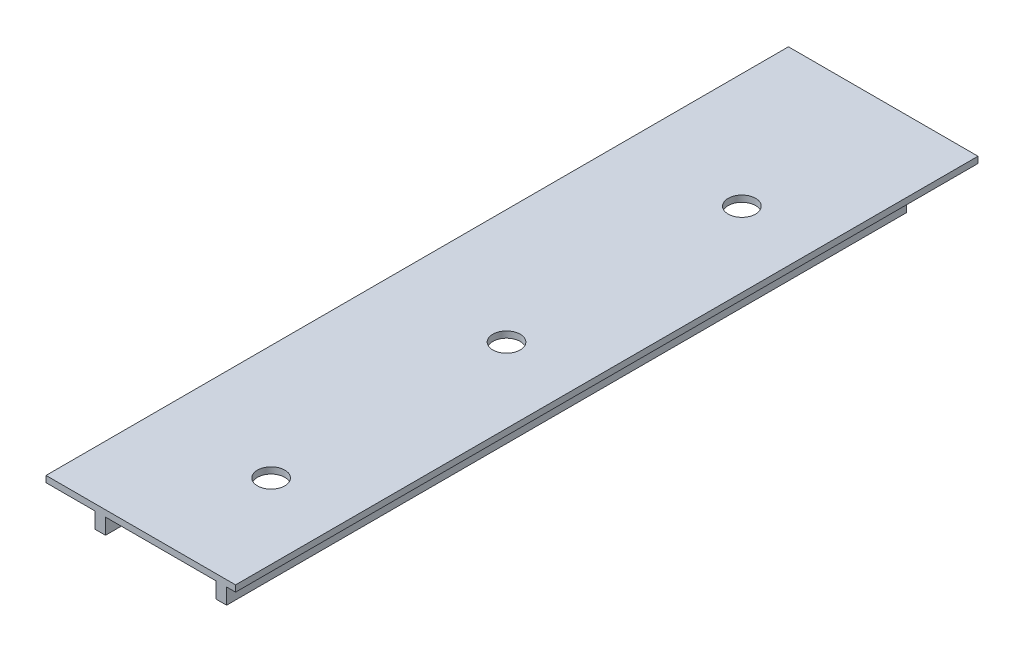
ISO-10303-21;
HEADER;
FILE_DESCRIPTION(('STEP AP214'),'2;1');
FILE_NAME('part.step','',(''),(''),'','','');
FILE_SCHEMA(('AUTOMOTIVE_DESIGN { 1 0 10303 214 1 1 1 1 }'));
ENDSEC;
DATA;
#1=APPLICATION_CONTEXT('core data for automotive mechanical design processes');
#2=APPLICATION_PROTOCOL_DEFINITION('international standard','automotive_design',2000,#1);
#3=PRODUCT_CONTEXT('',#1,'mechanical');
#4=PRODUCT('Part','Part','',(#3));
#5=PRODUCT_RELATED_PRODUCT_CATEGORY('part','',(#4));
#6=PRODUCT_DEFINITION_FORMATION('','',#4);
#7=PRODUCT_DEFINITION_CONTEXT('part definition',#1,'design');
#8=PRODUCT_DEFINITION('design','',#6,#7);
#9=PRODUCT_DEFINITION_SHAPE('','',#8);
#10=(LENGTH_UNIT() NAMED_UNIT(*) SI_UNIT(.MILLI.,.METRE.));
#11=(NAMED_UNIT(*) PLANE_ANGLE_UNIT() SI_UNIT($,.RADIAN.));
#12=(NAMED_UNIT(*) SI_UNIT($,.STERADIAN.) SOLID_ANGLE_UNIT());
#13=UNCERTAINTY_MEASURE_WITH_UNIT(LENGTH_MEASURE(1.E-05),#10,'distance_accuracy_value','');
#14=(GEOMETRIC_REPRESENTATION_CONTEXT(3) GLOBAL_UNCERTAINTY_ASSIGNED_CONTEXT((#13)) GLOBAL_UNIT_ASSIGNED_CONTEXT((#10,
#11,#12)) REPRESENTATION_CONTEXT('',''));
#15=CARTESIAN_POINT('',(0.,0.,0.));
#16=DIRECTION('',(0.,0.,1.));
#17=DIRECTION('',(1.,0.,0.));
#18=AXIS2_PLACEMENT_3D('',#15,#16,#17);
#19=CARTESIAN_POINT('',(0.,0.6,0.));
#20=DIRECTION('',(1.,0.,0.));
#21=DIRECTION('',(0.,0.,-1.));
#22=AXIS2_PLACEMENT_3D('',#19,#20,#21);
#23=PLANE('',#22);
#24=DIRECTION('',(0.,0.,1.));
#25=VECTOR('',#24,1.);
#26=CARTESIAN_POINT('',(0.,0.,0.));
#27=LINE('',#26,#25);
#28=CARTESIAN_POINT('',(0.,0.,-70.5));
#29=VERTEX_POINT('',#28);
#30=CARTESIAN_POINT('',(0.,0.,0.));
#31=VERTEX_POINT('',#30);
#32=EDGE_CURVE('E212',#29,#31,#27,.T.);
#33=ORIENTED_EDGE('',*,*,#32,.T.);
#34=DIRECTION('',(0.,-1.,0.));
#35=VECTOR('',#34,1.);
#36=CARTESIAN_POINT('',(0.,0.6,0.));
#37=LINE('',#36,#35);
#38=CARTESIAN_POINT('',(0.,0.6,0.));
#39=VERTEX_POINT('',#38);
#40=EDGE_CURVE('E11',#39,#31,#37,.T.);
#41=ORIENTED_EDGE('',*,*,#40,.F.);
#42=DIRECTION('',(0.,0.,1.));
#43=VECTOR('',#42,1.);
#44=CARTESIAN_POINT('',(0.,0.6,0.));
#45=LINE('',#44,#43);
#46=CARTESIAN_POINT('',(0.,0.6,-70.5));
#47=VERTEX_POINT('',#46);
#48=EDGE_CURVE('E201',#47,#39,#45,.T.);
#49=ORIENTED_EDGE('',*,*,#48,.F.);
#50=DIRECTION('',(0.,-1.,0.));
#51=VECTOR('',#50,1.);
#52=CARTESIAN_POINT('',(0.,0.6,-70.5));
#53=LINE('',#52,#51);
#54=EDGE_CURVE('E211',#47,#29,#53,.T.);
#55=ORIENTED_EDGE('',*,*,#54,.T.);
#56=EDGE_LOOP('',(#33,#41,#49,#55));
#57=FACE_BOUND('',#56,.T.);
#58=ADVANCED_FACE('F35',(#57),#23,.F.);
#59=CARTESIAN_POINT('',(0.,0.6,0.));
#60=DIRECTION('',(0.,0.,-1.));
#61=DIRECTION('',(-1.,0.,0.));
#62=AXIS2_PLACEMENT_3D('',#59,#60,#61);
#63=PLANE('',#62);
#64=DIRECTION('',(1.,0.,0.));
#65=VECTOR('',#64,1.);
#66=CARTESIAN_POINT('',(0.,0.,0.));
#67=LINE('',#66,#65);
#68=CARTESIAN_POINT('',(4.65,0.,0.));
#69=VERTEX_POINT('',#68);
#70=EDGE_CURVE('E216',#31,#69,#67,.T.);
#71=ORIENTED_EDGE('',*,*,#70,.T.);
#72=DIRECTION('',(0.,1.,0.));
#73=VECTOR('',#72,1.);
#74=CARTESIAN_POINT('',(4.65,-1.5,0.));
#75=LINE('',#74,#73);
#76=CARTESIAN_POINT('',(4.65,-1.5,0.));
#77=VERTEX_POINT('',#76);
#78=EDGE_CURVE('E135',#77,#69,#75,.T.);
#79=ORIENTED_EDGE('',*,*,#78,.F.);
#80=DIRECTION('',(-1.,0.,0.));
#81=VECTOR('',#80,1.);
#82=CARTESIAN_POINT('',(0.,-1.5,0.));
#83=LINE('',#82,#81);
#84=CARTESIAN_POINT('',(5.65,-1.5,0.));
#85=VERTEX_POINT('',#84);
#86=EDGE_CURVE('E138',#85,#77,#83,.T.);
#87=ORIENTED_EDGE('',*,*,#86,.F.);
#88=DIRECTION('',(0.,1.,0.));
#89=VECTOR('',#88,1.);
#90=CARTESIAN_POINT('',(5.65,-1.5,0.));
#91=LINE('',#90,#89);
#92=CARTESIAN_POINT('',(5.65,0.,0.));
#93=VERTEX_POINT('',#92);
#94=EDGE_CURVE('E126',#85,#93,#91,.T.);
#95=ORIENTED_EDGE('',*,*,#94,.T.);
#96=CARTESIAN_POINT('',(16.15,0.,0.));
#97=VERTEX_POINT('',#96);
#98=EDGE_CURVE('E219',#93,#97,#67,.T.);
#99=ORIENTED_EDGE('',*,*,#98,.T.);
#100=DIRECTION('',(0.,1.,0.));
#101=VECTOR('',#100,1.);
#102=CARTESIAN_POINT('',(16.15,-1.5,0.));
#103=LINE('',#102,#101);
#104=CARTESIAN_POINT('',(16.15,-1.5,0.));
#105=VERTEX_POINT('',#104);
#106=EDGE_CURVE('E182',#105,#97,#103,.T.);
#107=ORIENTED_EDGE('',*,*,#106,.F.);
#108=DIRECTION('',(-1.,0.,0.));
#109=VECTOR('',#108,1.);
#110=CARTESIAN_POINT('',(0.,-1.5,0.));
#111=LINE('',#110,#109);
#112=CARTESIAN_POINT('',(17.15,-1.5,0.));
#113=VERTEX_POINT('',#112);
#114=EDGE_CURVE('E170',#113,#105,#111,.T.);
#115=ORIENTED_EDGE('',*,*,#114,.F.);
#116=DIRECTION('',(0.,1.,0.));
#117=VECTOR('',#116,1.);
#118=CARTESIAN_POINT('',(17.15,-1.5,0.));
#119=LINE('',#118,#117);
#120=CARTESIAN_POINT('',(17.15,0.,0.));
#121=VERTEX_POINT('',#120);
#122=EDGE_CURVE('E185',#113,#121,#119,.T.);
#123=ORIENTED_EDGE('',*,*,#122,.T.);
#124=CARTESIAN_POINT('',(18.,0.,0.));
#125=VERTEX_POINT('',#124);
#126=EDGE_CURVE('E215',#121,#125,#67,.T.);
#127=ORIENTED_EDGE('',*,*,#126,.T.);
#128=DIRECTION('',(0.,-1.,0.));
#129=VECTOR('',#128,1.);
#130=CARTESIAN_POINT('',(18.,0.6,0.));
#131=LINE('',#130,#129);
#132=CARTESIAN_POINT('',(18.,0.6,0.));
#133=VERTEX_POINT('',#132);
#134=EDGE_CURVE('E43',#133,#125,#131,.T.);
#135=ORIENTED_EDGE('',*,*,#134,.F.);
#136=DIRECTION('',(1.,0.,0.));
#137=VECTOR('',#136,1.);
#138=CARTESIAN_POINT('',(0.,0.6,0.));
#139=LINE('',#138,#137);
#140=EDGE_CURVE('E204',#39,#133,#139,.T.);
#141=ORIENTED_EDGE('',*,*,#140,.F.);
#142=ORIENTED_EDGE('',*,*,#40,.T.);
#143=EDGE_LOOP('',(#71,#79,#87,#95,#99,#107,#115,#123,#127,#135,#141,#142));
#144=FACE_BOUND('',#143,.T.);
#145=ADVANCED_FACE('F140',(#144),#63,.F.);
#146=CARTESIAN_POINT('',(18.,0.6,0.));
#147=DIRECTION('',(-1.,0.,0.));
#148=DIRECTION('',(0.,0.,1.));
#149=AXIS2_PLACEMENT_3D('',#146,#147,#148);
#150=PLANE('',#149);
#151=DIRECTION('',(0.,0.,-1.));
#152=VECTOR('',#151,1.);
#153=CARTESIAN_POINT('',(18.,0.,0.));
#154=LINE('',#153,#152);
#155=CARTESIAN_POINT('',(18.,0.,-70.5));
#156=VERTEX_POINT('',#155);
#157=EDGE_CURVE('E218',#125,#156,#154,.T.);
#158=ORIENTED_EDGE('',*,*,#157,.T.);
#159=DIRECTION('',(0.,-1.,0.));
#160=VECTOR('',#159,1.);
#161=CARTESIAN_POINT('',(18.,0.6,-70.5));
#162=LINE('',#161,#160);
#163=CARTESIAN_POINT('',(18.,0.6,-70.5));
#164=VERTEX_POINT('',#163);
#165=EDGE_CURVE('E224',#164,#156,#162,.T.);
#166=ORIENTED_EDGE('',*,*,#165,.F.);
#167=DIRECTION('',(0.,0.,-1.));
#168=VECTOR('',#167,1.);
#169=CARTESIAN_POINT('',(18.,0.6,0.));
#170=LINE('',#169,#168);
#171=EDGE_CURVE('E207',#133,#164,#170,.T.);
#172=ORIENTED_EDGE('',*,*,#171,.F.);
#173=ORIENTED_EDGE('',*,*,#134,.T.);
#174=EDGE_LOOP('',(#158,#166,#172,#173));
#175=FACE_BOUND('',#174,.T.);
#176=ADVANCED_FACE('F271',(#175),#150,.F.);
#177=CARTESIAN_POINT('',(0.,0.6,-70.5));
#178=DIRECTION('',(0.,0.,1.));
#179=DIRECTION('',(1.,0.,0.));
#180=AXIS2_PLACEMENT_3D('',#177,#178,#179);
#181=PLANE('',#180);
#182=DIRECTION('',(-1.,0.,0.));
#183=VECTOR('',#182,1.);
#184=CARTESIAN_POINT('',(0.,0.,-70.5));
#185=LINE('',#184,#183);
#186=EDGE_CURVE('E205',#156,#29,#185,.T.);
#187=ORIENTED_EDGE('',*,*,#186,.T.);
#188=ORIENTED_EDGE('',*,*,#54,.F.);
#189=DIRECTION('',(-1.,0.,0.));
#190=VECTOR('',#189,1.);
#191=CARTESIAN_POINT('',(0.,0.6,-70.5));
#192=LINE('',#191,#190);
#193=EDGE_CURVE('E209',#164,#47,#192,.T.);
#194=ORIENTED_EDGE('',*,*,#193,.F.);
#195=ORIENTED_EDGE('',*,*,#165,.T.);
#196=EDGE_LOOP('',(#187,#188,#194,#195));
#197=FACE_BOUND('',#196,.T.);
#198=ADVANCED_FACE('F257',(#197),#181,.F.);
#199=CARTESIAN_POINT('',(0.,0.6,0.));
#200=DIRECTION('',(0.,-1.,0.));
#201=DIRECTION('',(0.,0.,-1.));
#202=AXIS2_PLACEMENT_3D('',#199,#200,#201);
#203=PLANE('',#202);
#204=CARTESIAN_POINT('',(10.9,0.6,-10.48));
#205=DIRECTION('',(0.,1.,0.));
#206=DIRECTION('',(0.,0.,1.));
#207=AXIS2_PLACEMENT_3D('',#204,#205,#206);
#208=CIRCLE('',#207,1.3);
#209=CARTESIAN_POINT('',(10.9,0.6,-9.18));
#210=VERTEX_POINT('',#209);
#211=EDGE_CURVE('E192',#210,#210,#208,.T.);
#212=ORIENTED_EDGE('',*,*,#211,.F.);
#213=EDGE_LOOP('',(#212));
#214=FACE_BOUND('',#213,.T.);
#215=CARTESIAN_POINT('',(10.9,0.6,-32.83));
#216=DIRECTION('',(0.,1.,0.));
#217=DIRECTION('',(0.,0.,1.));
#218=AXIS2_PLACEMENT_3D('',#215,#216,#217);
#219=CIRCLE('',#218,1.3);
#220=CARTESIAN_POINT('',(10.9,0.6,-31.53));
#221=VERTEX_POINT('',#220);
#222=EDGE_CURVE('E196',#221,#221,#219,.T.);
#223=ORIENTED_EDGE('',*,*,#222,.F.);
#224=EDGE_LOOP('',(#223));
#225=FACE_BOUND('',#224,.T.);
#226=CARTESIAN_POINT('',(10.9,0.6,-55.18));
#227=DIRECTION('',(0.,1.,0.));
#228=DIRECTION('',(0.,0.,1.));
#229=AXIS2_PLACEMENT_3D('',#226,#227,#228);
#230=CIRCLE('',#229,1.3);
#231=CARTESIAN_POINT('',(10.9,0.6,-53.88));
#232=VERTEX_POINT('',#231);
#233=EDGE_CURVE('E191',#232,#232,#230,.T.);
#234=ORIENTED_EDGE('',*,*,#233,.F.);
#235=EDGE_LOOP('',(#234));
#236=FACE_BOUND('',#235,.T.);
#237=ORIENTED_EDGE('',*,*,#48,.T.);
#238=ORIENTED_EDGE('',*,*,#140,.T.);
#239=ORIENTED_EDGE('',*,*,#171,.T.);
#240=ORIENTED_EDGE('',*,*,#193,.T.);
#241=EDGE_LOOP('',(#237,#238,#239,#240));
#242=FACE_BOUND('',#241,.T.);
#243=ADVANCED_FACE('F244',(#214,#225,#236,#242),#203,.F.);
#244=CARTESIAN_POINT('',(0.,0.,0.));
#245=DIRECTION('',(0.,-1.,0.));
#246=DIRECTION('',(0.,0.,-1.));
#247=AXIS2_PLACEMENT_3D('',#244,#245,#246);
#248=PLANE('',#247);
#249=DIRECTION('',(0.,0.,-1.));
#250=VECTOR('',#249,1.);
#251=CARTESIAN_POINT('',(5.65,0.,0.));
#252=LINE('',#251,#250);
#253=CARTESIAN_POINT('',(5.65,0.,-64.56));
#254=VERTEX_POINT('',#253);
#255=EDGE_CURVE('E132',#93,#254,#252,.T.);
#256=ORIENTED_EDGE('',*,*,#255,.T.);
#257=DIRECTION('',(1.,0.,0.));
#258=VECTOR('',#257,1.);
#259=CARTESIAN_POINT('',(0.,0.,-64.56));
#260=LINE('',#259,#258);
#261=CARTESIAN_POINT('',(4.65,0.,-64.56));
#262=VERTEX_POINT('',#261);
#263=EDGE_CURVE('E150',#262,#254,#260,.T.);
#264=ORIENTED_EDGE('',*,*,#263,.F.);
#265=DIRECTION('',(0.,0.,1.));
#266=VECTOR('',#265,1.);
#267=CARTESIAN_POINT('',(4.65,0.,0.));
#268=LINE('',#267,#266);
#269=EDGE_CURVE('E51',#262,#69,#268,.T.);
#270=ORIENTED_EDGE('',*,*,#269,.T.);
#271=ORIENTED_EDGE('',*,*,#70,.F.);
#272=ORIENTED_EDGE('',*,*,#32,.F.);
#273=ORIENTED_EDGE('',*,*,#186,.F.);
#274=ORIENTED_EDGE('',*,*,#157,.F.);
#275=ORIENTED_EDGE('',*,*,#126,.F.);
#276=DIRECTION('',(0.,0.,1.));
#277=VECTOR('',#276,1.);
#278=CARTESIAN_POINT('',(17.15,0.,0.));
#279=LINE('',#278,#277);
#280=CARTESIAN_POINT('',(17.15,0.,-64.56));
#281=VERTEX_POINT('',#280);
#282=EDGE_CURVE('E176',#281,#121,#279,.T.);
#283=ORIENTED_EDGE('',*,*,#282,.F.);
#284=DIRECTION('',(1.,0.,0.));
#285=VECTOR('',#284,1.);
#286=CARTESIAN_POINT('',(0.,0.,-64.56));
#287=LINE('',#286,#285);
#288=CARTESIAN_POINT('',(16.15,0.,-64.56));
#289=VERTEX_POINT('',#288);
#290=EDGE_CURVE('E59',#289,#281,#287,.T.);
#291=ORIENTED_EDGE('',*,*,#290,.F.);
#292=DIRECTION('',(0.,0.,-1.));
#293=VECTOR('',#292,1.);
#294=CARTESIAN_POINT('',(16.15,0.,0.));
#295=LINE('',#294,#293);
#296=EDGE_CURVE('E168',#97,#289,#295,.T.);
#297=ORIENTED_EDGE('',*,*,#296,.F.);
#298=ORIENTED_EDGE('',*,*,#98,.F.);
#299=EDGE_LOOP('',(#256,#264,#270,#271,#272,#273,#274,#275,#283,#291,#297,#298));
#300=FACE_BOUND('',#299,.T.);
#301=CARTESIAN_POINT('',(10.9,0.,-10.48));
#302=DIRECTION('',(0.,-1.,0.));
#303=DIRECTION('',(0.,0.,-1.));
#304=AXIS2_PLACEMENT_3D('',#301,#302,#303);
#305=CIRCLE('',#304,1.3);
#306=CARTESIAN_POINT('',(10.9,0.,-11.78));
#307=VERTEX_POINT('',#306);
#308=EDGE_CURVE('E38',#307,#307,#305,.T.);
#309=ORIENTED_EDGE('',*,*,#308,.F.);
#310=EDGE_LOOP('',(#309));
#311=FACE_BOUND('',#310,.T.);
#312=CARTESIAN_POINT('',(10.9,0.,-32.83));
#313=DIRECTION('',(0.,-1.,0.));
#314=DIRECTION('',(0.,0.,-1.));
#315=AXIS2_PLACEMENT_3D('',#312,#313,#314);
#316=CIRCLE('',#315,1.3);
#317=CARTESIAN_POINT('',(10.9,0.,-34.13));
#318=VERTEX_POINT('',#317);
#319=EDGE_CURVE('E230',#318,#318,#316,.T.);
#320=ORIENTED_EDGE('',*,*,#319,.F.);
#321=EDGE_LOOP('',(#320));
#322=FACE_BOUND('',#321,.T.);
#323=CARTESIAN_POINT('',(10.9,0.,-55.18));
#324=DIRECTION('',(0.,-1.,0.));
#325=DIRECTION('',(0.,0.,-1.));
#326=AXIS2_PLACEMENT_3D('',#323,#324,#325);
#327=CIRCLE('',#326,1.3);
#328=CARTESIAN_POINT('',(10.9,0.,-56.48));
#329=VERTEX_POINT('',#328);
#330=EDGE_CURVE('E195',#329,#329,#327,.T.);
#331=ORIENTED_EDGE('',*,*,#330,.F.);
#332=EDGE_LOOP('',(#331));
#333=FACE_BOUND('',#332,.T.);
#334=ADVANCED_FACE('F240',(#300,#311,#322,#333),#248,.T.);
#335=CARTESIAN_POINT('',(10.9,-9.4,-55.18));
#336=DIRECTION('',(0.,1.,0.));
#337=DIRECTION('',(0.,0.,1.));
#338=AXIS2_PLACEMENT_3D('',#335,#336,#337);
#339=CYLINDRICAL_SURFACE('',#338,1.3);
#340=ORIENTED_EDGE('',*,*,#330,.T.);
#341=EDGE_LOOP('',(#340));
#342=FACE_BOUND('',#341,.T.);
#343=ORIENTED_EDGE('',*,*,#233,.T.);
#344=EDGE_LOOP('',(#343));
#345=FACE_BOUND('',#344,.T.);
#346=ADVANCED_FACE('F243',(#342,#345),#339,.F.);
#347=CARTESIAN_POINT('',(10.9,-9.4,-32.83));
#348=DIRECTION('',(0.,1.,0.));
#349=DIRECTION('',(0.,0.,1.));
#350=AXIS2_PLACEMENT_3D('',#347,#348,#349);
#351=CYLINDRICAL_SURFACE('',#350,1.3);
#352=ORIENTED_EDGE('',*,*,#319,.T.);
#353=EDGE_LOOP('',(#352));
#354=FACE_BOUND('',#353,.T.);
#355=ORIENTED_EDGE('',*,*,#222,.T.);
#356=EDGE_LOOP('',(#355));
#357=FACE_BOUND('',#356,.T.);
#358=ADVANCED_FACE('F251',(#354,#357),#351,.F.);
#359=CARTESIAN_POINT('',(10.9,-9.4,-10.48));
#360=DIRECTION('',(0.,1.,0.));
#361=DIRECTION('',(0.,0.,1.));
#362=AXIS2_PLACEMENT_3D('',#359,#360,#361);
#363=CYLINDRICAL_SURFACE('',#362,1.3);
#364=ORIENTED_EDGE('',*,*,#308,.T.);
#365=EDGE_LOOP('',(#364));
#366=FACE_BOUND('',#365,.T.);
#367=ORIENTED_EDGE('',*,*,#211,.T.);
#368=EDGE_LOOP('',(#367));
#369=FACE_BOUND('',#368,.T.);
#370=ADVANCED_FACE('F237',(#366,#369),#363,.F.);
#371=CARTESIAN_POINT('',(0.,-1.5,-64.56));
#372=DIRECTION('',(0.,0.,1.));
#373=DIRECTION('',(1.,0.,0.));
#374=AXIS2_PLACEMENT_3D('',#371,#372,#373);
#375=PLANE('',#374);
#376=ORIENTED_EDGE('',*,*,#290,.T.);
#377=DIRECTION('',(0.,1.,0.));
#378=VECTOR('',#377,1.);
#379=CARTESIAN_POINT('',(17.15,-1.5,-64.56));
#380=LINE('',#379,#378);
#381=CARTESIAN_POINT('',(17.15,-1.5,-64.56));
#382=VERTEX_POINT('',#381);
#383=EDGE_CURVE('E188',#382,#281,#380,.T.);
#384=ORIENTED_EDGE('',*,*,#383,.F.);
#385=DIRECTION('',(1.,0.,0.));
#386=VECTOR('',#385,1.);
#387=CARTESIAN_POINT('',(0.,-1.5,-64.56));
#388=LINE('',#387,#386);
#389=CARTESIAN_POINT('',(16.15,-1.5,-64.56));
#390=VERTEX_POINT('',#389);
#391=EDGE_CURVE('E164',#390,#382,#388,.T.);
#392=ORIENTED_EDGE('',*,*,#391,.F.);
#393=DIRECTION('',(0.,1.,0.));
#394=VECTOR('',#393,1.);
#395=CARTESIAN_POINT('',(16.15,-1.5,-64.56));
#396=LINE('',#395,#394);
#397=EDGE_CURVE('E174',#390,#289,#396,.T.);
#398=ORIENTED_EDGE('',*,*,#397,.T.);
#399=EDGE_LOOP('',(#376,#384,#392,#398));
#400=FACE_BOUND('',#399,.T.);
#401=ADVANCED_FACE('F302',(#400),#375,.F.);
#402=CARTESIAN_POINT('',(17.15,-1.5,0.));
#403=DIRECTION('',(-1.,0.,0.));
#404=DIRECTION('',(0.,0.,1.));
#405=AXIS2_PLACEMENT_3D('',#402,#403,#404);
#406=PLANE('',#405);
#407=ORIENTED_EDGE('',*,*,#282,.T.);
#408=ORIENTED_EDGE('',*,*,#122,.F.);
#409=DIRECTION('',(0.,0.,1.));
#410=VECTOR('',#409,1.);
#411=CARTESIAN_POINT('',(17.15,-1.5,0.));
#412=LINE('',#411,#410);
#413=EDGE_CURVE('E167',#382,#113,#412,.T.);
#414=ORIENTED_EDGE('',*,*,#413,.F.);
#415=ORIENTED_EDGE('',*,*,#383,.T.);
#416=EDGE_LOOP('',(#407,#408,#414,#415));
#417=FACE_BOUND('',#416,.T.);
#418=ADVANCED_FACE('F305',(#417),#406,.F.);
#419=CARTESIAN_POINT('',(16.15,-1.5,0.));
#420=DIRECTION('',(1.,0.,0.));
#421=DIRECTION('',(0.,0.,-1.));
#422=AXIS2_PLACEMENT_3D('',#419,#420,#421);
#423=PLANE('',#422);
#424=ORIENTED_EDGE('',*,*,#296,.T.);
#425=ORIENTED_EDGE('',*,*,#397,.F.);
#426=DIRECTION('',(0.,0.,-1.));
#427=VECTOR('',#426,1.);
#428=CARTESIAN_POINT('',(16.15,-1.5,0.));
#429=LINE('',#428,#427);
#430=EDGE_CURVE('E172',#105,#390,#429,.T.);
#431=ORIENTED_EDGE('',*,*,#430,.F.);
#432=ORIENTED_EDGE('',*,*,#106,.T.);
#433=EDGE_LOOP('',(#424,#425,#431,#432));
#434=FACE_BOUND('',#433,.T.);
#435=ADVANCED_FACE('F309',(#434),#423,.F.);
#436=CARTESIAN_POINT('',(0.,-1.5,0.));
#437=DIRECTION('',(0.,-1.,0.));
#438=DIRECTION('',(0.,0.,-1.));
#439=AXIS2_PLACEMENT_3D('',#436,#437,#438);
#440=PLANE('',#439);
#441=ORIENTED_EDGE('',*,*,#391,.T.);
#442=ORIENTED_EDGE('',*,*,#413,.T.);
#443=ORIENTED_EDGE('',*,*,#114,.T.);
#444=ORIENTED_EDGE('',*,*,#430,.T.);
#445=EDGE_LOOP('',(#441,#442,#443,#444));
#446=FACE_BOUND('',#445,.T.);
#447=ADVANCED_FACE('F285',(#446),#440,.T.);
#448=CARTESIAN_POINT('',(5.65,-1.5,0.));
#449=DIRECTION('',(1.,0.,0.));
#450=DIRECTION('',(0.,0.,-1.));
#451=AXIS2_PLACEMENT_3D('',#448,#449,#450);
#452=PLANE('',#451);
#453=ORIENTED_EDGE('',*,*,#255,.F.);
#454=ORIENTED_EDGE('',*,*,#94,.F.);
#455=DIRECTION('',(0.,0.,-1.));
#456=VECTOR('',#455,1.);
#457=CARTESIAN_POINT('',(5.65,-1.5,0.));
#458=LINE('',#457,#456);
#459=CARTESIAN_POINT('',(5.65,-1.5,-64.56));
#460=VERTEX_POINT('',#459);
#461=EDGE_CURVE('E130',#85,#460,#458,.T.);
#462=ORIENTED_EDGE('',*,*,#461,.T.);
#463=DIRECTION('',(0.,1.,0.));
#464=VECTOR('',#463,1.);
#465=CARTESIAN_POINT('',(5.65,-1.5,-64.56));
#466=LINE('',#465,#464);
#467=EDGE_CURVE('E157',#460,#254,#466,.T.);
#468=ORIENTED_EDGE('',*,*,#467,.T.);
#469=EDGE_LOOP('',(#453,#454,#462,#468));
#470=FACE_BOUND('',#469,.T.);
#471=ADVANCED_FACE('F128',(#470),#452,.T.);
#472=CARTESIAN_POINT('',(4.65,-1.5,0.));
#473=DIRECTION('',(-1.,0.,0.));
#474=DIRECTION('',(0.,0.,1.));
#475=AXIS2_PLACEMENT_3D('',#472,#473,#474);
#476=PLANE('',#475);
#477=ORIENTED_EDGE('',*,*,#269,.F.);
#478=DIRECTION('',(0.,1.,0.));
#479=VECTOR('',#478,1.);
#480=CARTESIAN_POINT('',(4.65,-1.5,-64.56));
#481=LINE('',#480,#479);
#482=CARTESIAN_POINT('',(4.65,-1.5,-64.56));
#483=VERTEX_POINT('',#482);
#484=EDGE_CURVE('E161',#483,#262,#481,.T.);
#485=ORIENTED_EDGE('',*,*,#484,.F.);
#486=DIRECTION('',(0.,0.,1.));
#487=VECTOR('',#486,1.);
#488=CARTESIAN_POINT('',(4.65,-1.5,0.));
#489=LINE('',#488,#487);
#490=EDGE_CURVE('E144',#483,#77,#489,.T.);
#491=ORIENTED_EDGE('',*,*,#490,.T.);
#492=ORIENTED_EDGE('',*,*,#78,.T.);
#493=EDGE_LOOP('',(#477,#485,#491,#492));
#494=FACE_BOUND('',#493,.T.);
#495=ADVANCED_FACE('F277',(#494),#476,.T.);
#496=CARTESIAN_POINT('',(0.,-1.5,-64.56));
#497=DIRECTION('',(0.,0.,1.));
#498=DIRECTION('',(1.,0.,0.));
#499=AXIS2_PLACEMENT_3D('',#496,#497,#498);
#500=PLANE('',#499);
#501=ORIENTED_EDGE('',*,*,#263,.T.);
#502=ORIENTED_EDGE('',*,*,#467,.F.);
#503=DIRECTION('',(1.,0.,0.));
#504=VECTOR('',#503,1.);
#505=CARTESIAN_POINT('',(0.,-1.5,-64.56));
#506=LINE('',#505,#504);
#507=EDGE_CURVE('E148',#483,#460,#506,.T.);
#508=ORIENTED_EDGE('',*,*,#507,.F.);
#509=ORIENTED_EDGE('',*,*,#484,.T.);
#510=EDGE_LOOP('',(#501,#502,#508,#509));
#511=FACE_BOUND('',#510,.T.);
#512=ADVANCED_FACE('F276',(#511),#500,.F.);
#513=CARTESIAN_POINT('',(0.,-1.5,0.));
#514=DIRECTION('',(0.,-1.,0.));
#515=DIRECTION('',(0.,0.,-1.));
#516=AXIS2_PLACEMENT_3D('',#513,#514,#515);
#517=PLANE('',#516);
#518=ORIENTED_EDGE('',*,*,#461,.F.);
#519=ORIENTED_EDGE('',*,*,#86,.T.);
#520=ORIENTED_EDGE('',*,*,#490,.F.);
#521=ORIENTED_EDGE('',*,*,#507,.T.);
#522=EDGE_LOOP('',(#518,#519,#520,#521));
#523=FACE_BOUND('',#522,.T.);
#524=ADVANCED_FACE('F146',(#523),#517,.T.);
#525=CLOSED_SHELL('',(#58,#145,#176,#198,#243,#334,#346,#358,#370,#401,#418,#435,#447,#471,#495,
#512,#524));
#526=MANIFOLD_SOLID_BREP('B2',#525);
#527=ADVANCED_BREP_SHAPE_REPRESENTATION('',(#18,#526),#14);
#528=SHAPE_DEFINITION_REPRESENTATION(#9,#527);
ENDSEC;
END-ISO-10303-21;
